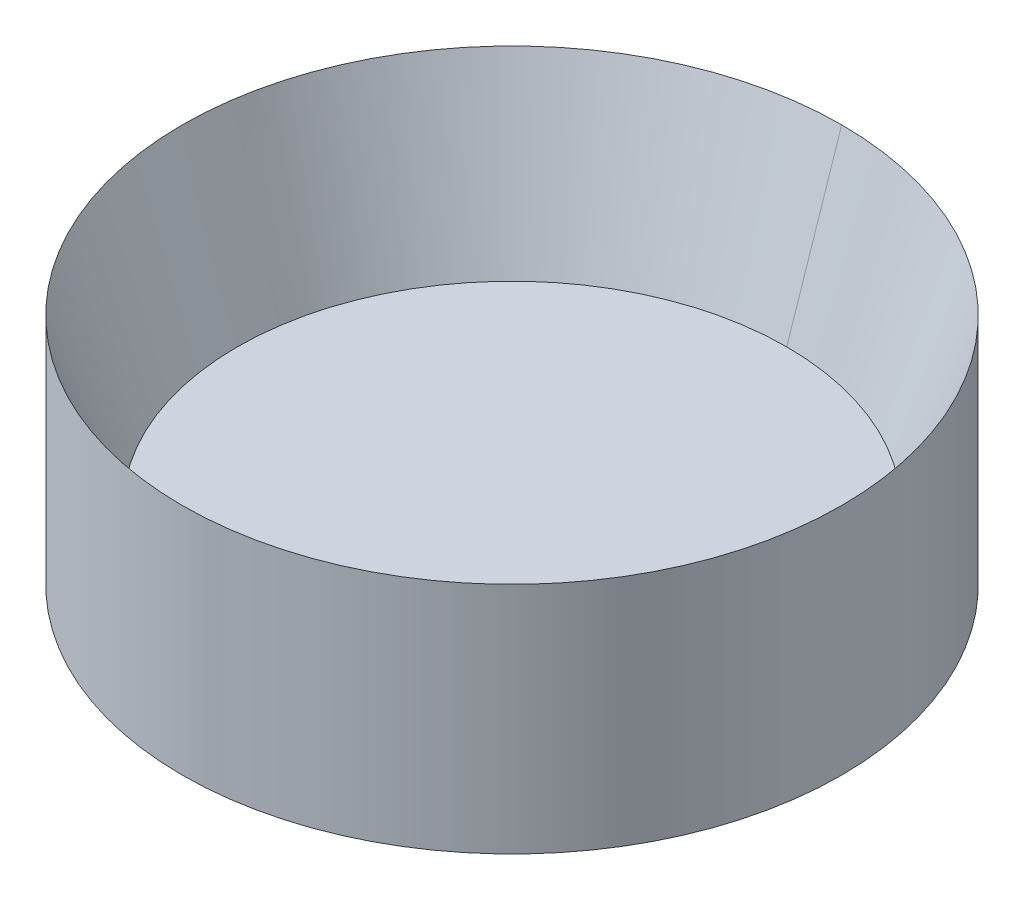
ISO-10303-21;
HEADER;
FILE_DESCRIPTION(('STEP AP214'),'2;1');
FILE_NAME('part.step','',(''),(''),'','','');
FILE_SCHEMA(('AUTOMOTIVE_DESIGN { 1 0 10303 214 1 1 1 1 }'));
ENDSEC;
DATA;
#1=APPLICATION_CONTEXT('core data for automotive mechanical design processes');
#2=APPLICATION_PROTOCOL_DEFINITION('international standard','automotive_design',2000,#1);
#3=PRODUCT_CONTEXT('',#1,'mechanical');
#4=PRODUCT('Part','Part','',(#3));
#5=PRODUCT_RELATED_PRODUCT_CATEGORY('part','',(#4));
#6=PRODUCT_DEFINITION_FORMATION('','',#4);
#7=PRODUCT_DEFINITION_CONTEXT('part definition',#1,'design');
#8=PRODUCT_DEFINITION('design','',#6,#7);
#9=PRODUCT_DEFINITION_SHAPE('','',#8);
#10=(LENGTH_UNIT() NAMED_UNIT(*) SI_UNIT(.MILLI.,.METRE.));
#11=(NAMED_UNIT(*) PLANE_ANGLE_UNIT() SI_UNIT($,.RADIAN.));
#12=(NAMED_UNIT(*) SI_UNIT($,.STERADIAN.) SOLID_ANGLE_UNIT());
#13=UNCERTAINTY_MEASURE_WITH_UNIT(LENGTH_MEASURE(1.E-05),#10,'distance_accuracy_value','');
#14=(GEOMETRIC_REPRESENTATION_CONTEXT(3) GLOBAL_UNCERTAINTY_ASSIGNED_CONTEXT((#13)) GLOBAL_UNIT_ASSIGNED_CONTEXT((#10,
#11,#12)) REPRESENTATION_CONTEXT('',''));
#15=CARTESIAN_POINT('',(0.,0.,0.));
#16=DIRECTION('',(0.,0.,1.));
#17=DIRECTION('',(1.,0.,0.));
#18=AXIS2_PLACEMENT_3D('',#15,#16,#17);
#19=CARTESIAN_POINT('',(-72.39499366416,-2.676384400526,-46.24331973759));
#20=DIRECTION('',(0.,-1.,0.));
#21=DIRECTION('',(0.,0.,-1.));
#22=AXIS2_PLACEMENT_3D('',#19,#20,#21);
#23=PLANE('',#22);
#24=CARTESIAN_POINT('',(-68.74999366424,-2.67638440055862,-46.24331973764));
#25=DIRECTION('',(0.,1.,0.));
#26=DIRECTION('',(0.,0.,1.));
#27=AXIS2_PLACEMENT_3D('',#24,#25,#26);
#28=CIRCLE('',#27,0.199999999976934);
#29=CARTESIAN_POINT('',(-68.74999366424,-2.67638440050177,-46.4433197376318));
#30=VERTEX_POINT('',#29);
#31=CARTESIAN_POINT('',(-68.74999366424,-2.67638440050177,-46.0433197376482));
#32=VERTEX_POINT('',#31);
#33=EDGE_CURVE('E19',#30,#32,#28,.T.);
#34=ORIENTED_EDGE('',*,*,#33,.T.);
#35=CARTESIAN_POINT('',(-68.74999366424,-2.67638440044493,-46.24331973764));
#36=DIRECTION('',(0.,1.,0.));
#37=DIRECTION('',(0.,0.,1.));
#38=AXIS2_PLACEMENT_3D('',#35,#36,#37);
#39=CIRCLE('',#38,0.200000000005356);
#40=EDGE_CURVE('E46',#32,#30,#39,.T.);
#41=ORIENTED_EDGE('',*,*,#40,.T.);
#42=EDGE_LOOP('',(#34,#41));
#43=FACE_BOUND('',#42,.T.);
#44=ADVANCED_FACE('F16',(#43),#23,.F.);
#45=CARTESIAN_POINT('',(-68.74999366424,-2.55638440063422,-46.24331973764));
#46=DIRECTION('',(0.,1.,0.));
#47=DIRECTION('',(0.,0.,1.));
#48=AXIS2_PLACEMENT_3D('',#45,#46,#47);
#49=CONICAL_SURFACE('',#48,0.239999999961209,0.321750554467696);
#50=DIRECTION('',(0.,-0.948683298005497,0.31622776615189));
#51=VECTOR('',#50,1.);
#52=CARTESIAN_POINT('',(-68.7499936642196,499000.,-166380.668860134));
#53=LINE('',#52,#51);
#54=CARTESIAN_POINT('',(-68.74999366424,-2.55638440057255,-46.4833197376309));
#55=VERTEX_POINT('',#54);
#56=EDGE_CURVE('E48',#30,#55,#53,.F.);
#57=ORIENTED_EDGE('',*,*,#56,.T.);
#58=CARTESIAN_POINT('',(-68.74999366424,-2.556384400552,-46.24331973764));
#59=DIRECTION('',(0.,1.,0.));
#60=DIRECTION('',(0.,0.,1.));
#61=AXIS2_PLACEMENT_3D('',#58,#59,#60);
#62=CIRCLE('',#61,0.24);
#63=CARTESIAN_POINT('',(-68.74999366424,-2.55638440057255,-46.0033197376497));
#64=VERTEX_POINT('',#63);
#65=EDGE_CURVE('E51',#64,#55,#62,.F.);
#66=ORIENTED_EDGE('',*,*,#65,.F.);
#67=DIRECTION('',(0.,-0.948683298005497,-0.31622776615189));
#68=VECTOR('',#67,1.);
#69=CARTESIAN_POINT('',(-68.74999366424,499000.,166288.182220659));
#70=LINE('',#69,#68);
#71=EDGE_CURVE('E34',#64,#32,#70,.T.);
#72=ORIENTED_EDGE('',*,*,#71,.T.);
#73=ORIENTED_EDGE('',*,*,#33,.F.);
#74=EDGE_LOOP('',(#57,#66,#72,#73));
#75=FACE_BOUND('',#74,.T.);
#76=ADVANCED_FACE('F50',(#75),#49,.F.);
#77=CARTESIAN_POINT('',(-68.74999366424,-2.55638440063422,-46.24331973764));
#78=DIRECTION('',(0.,1.,0.));
#79=DIRECTION('',(0.,0.,1.));
#80=AXIS2_PLACEMENT_3D('',#77,#78,#79);
#81=CONICAL_SURFACE('',#80,0.239999999961209,0.321750554538751);
#82=ORIENTED_EDGE('',*,*,#40,.F.);
#83=ORIENTED_EDGE('',*,*,#71,.F.);
#84=CARTESIAN_POINT('',(-68.74999366424,-2.556384400552,-46.24331973764));
#85=DIRECTION('',(0.,1.,0.));
#86=DIRECTION('',(0.,0.,1.));
#87=AXIS2_PLACEMENT_3D('',#84,#85,#86);
#88=CIRCLE('',#87,0.24);
#89=EDGE_CURVE('E25',#55,#64,#88,.F.);
#90=ORIENTED_EDGE('',*,*,#89,.F.);
#91=ORIENTED_EDGE('',*,*,#56,.F.);
#92=EDGE_LOOP('',(#82,#83,#90,#91));
#93=FACE_BOUND('',#92,.T.);
#94=ADVANCED_FACE('F47',(#93),#81,.F.);
#95=CARTESIAN_POINT('',(-68.74999366424,-2.126384400507,-46.24331973764));
#96=DIRECTION('',(0.,1.,0.));
#97=DIRECTION('',(0.,0.,1.));
#98=AXIS2_PLACEMENT_3D('',#95,#96,#97);
#99=CYLINDRICAL_SURFACE('',#98,0.24);
#100=ORIENTED_EDGE('',*,*,#65,.T.);
#101=ORIENTED_EDGE('',*,*,#89,.T.);
#102=EDGE_LOOP('',(#100,#101));
#103=FACE_BOUND('',#102,.T.);
#104=CARTESIAN_POINT('',(-68.74999366424,-2.726384400507,-46.24331973764));
#105=DIRECTION('',(0.,1.,0.));
#106=DIRECTION('',(0.,0.,1.));
#107=AXIS2_PLACEMENT_3D('',#104,#105,#106);
#108=CIRCLE('',#107,0.24);
#109=CARTESIAN_POINT('',(-68.74999366424,-2.726384400507,-46.00331973764));
#110=VERTEX_POINT('',#109);
#111=EDGE_CURVE('E11',#110,#110,#108,.T.);
#112=ORIENTED_EDGE('',*,*,#111,.T.);
#113=EDGE_LOOP('',(#112));
#114=FACE_BOUND('',#113,.T.);
#115=ADVANCED_FACE('F65',(#103,#114),#99,.T.);
#116=CARTESIAN_POINT('',(-72.39501409646,-2.726384400507,-41.29331973764));
#117=DIRECTION('',(0.,1.,0.));
#118=DIRECTION('',(0.,0.,1.));
#119=AXIS2_PLACEMENT_3D('',#116,#117,#118);
#120=PLANE('',#119);
#121=ORIENTED_EDGE('',*,*,#111,.F.);
#122=EDGE_LOOP('',(#121));
#123=FACE_BOUND('',#122,.T.);
#124=ADVANCED_FACE('F68',(#123),#120,.F.);
#125=CLOSED_SHELL('',(#44,#76,#94,#115,#124));
#126=MANIFOLD_SOLID_BREP('B1',#125);
#127=ADVANCED_BREP_SHAPE_REPRESENTATION('',(#18,#126),#14);
#128=SHAPE_DEFINITION_REPRESENTATION(#9,#127);
ENDSEC;
END-ISO-10303-21;
